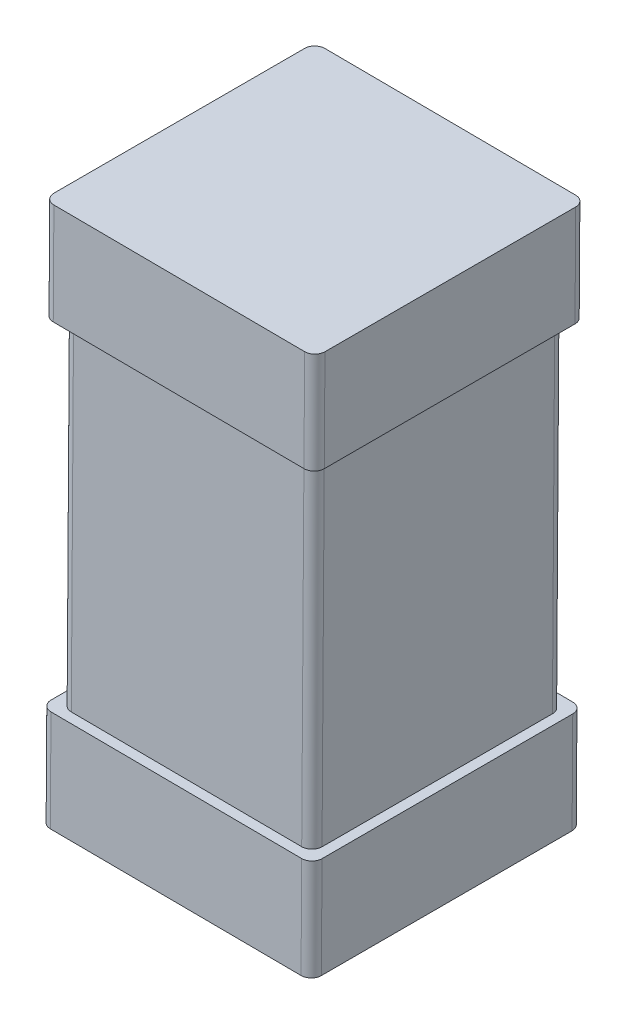
ISO-10303-21;
HEADER;
FILE_DESCRIPTION(('STEP AP214'),'2;1');
FILE_NAME('part.step','',(''),(''),'','','');
FILE_SCHEMA(('AUTOMOTIVE_DESIGN { 1 0 10303 214 1 1 1 1 }'));
ENDSEC;
DATA;
#1=APPLICATION_CONTEXT('core data for automotive mechanical design processes');
#2=APPLICATION_PROTOCOL_DEFINITION('international standard','automotive_design',2000,#1);
#3=PRODUCT_CONTEXT('',#1,'mechanical');
#4=PRODUCT('Part','Part','',(#3));
#5=PRODUCT_RELATED_PRODUCT_CATEGORY('part','',(#4));
#6=PRODUCT_DEFINITION_FORMATION('','',#4);
#7=PRODUCT_DEFINITION_CONTEXT('part definition',#1,'design');
#8=PRODUCT_DEFINITION('design','',#6,#7);
#9=PRODUCT_DEFINITION_SHAPE('','',#8);
#10=(LENGTH_UNIT() NAMED_UNIT(*) SI_UNIT(.MILLI.,.METRE.));
#11=(NAMED_UNIT(*) PLANE_ANGLE_UNIT() SI_UNIT($,.RADIAN.));
#12=(NAMED_UNIT(*) SI_UNIT($,.STERADIAN.) SOLID_ANGLE_UNIT());
#13=UNCERTAINTY_MEASURE_WITH_UNIT(LENGTH_MEASURE(1.E-05),#10,'distance_accuracy_value','');
#14=(GEOMETRIC_REPRESENTATION_CONTEXT(3) GLOBAL_UNCERTAINTY_ASSIGNED_CONTEXT((#13)) GLOBAL_UNIT_ASSIGNED_CONTEXT((#10,
#11,#12)) REPRESENTATION_CONTEXT('',''));
#15=CARTESIAN_POINT('',(0.,0.,0.));
#16=DIRECTION('',(0.,0.,1.));
#17=DIRECTION('',(1.,0.,0.));
#18=AXIS2_PLACEMENT_3D('',#15,#16,#17);
#19=CARTESIAN_POINT('',(197.940914667771,102.604065715772,142.211582908599));
#20=DIRECTION('',(0.00663069374923689,0.99997801670857,0.));
#21=DIRECTION('',(0.,0.,-1.));
#22=AXIS2_PLACEMENT_3D('',#19,#20,#21);
#23=PLANE('',#22);
#24=DIRECTION('',(0.,0.,1.));
#25=VECTOR('',#24,1.);
#26=CARTESIAN_POINT('',(197.940914667771,102.604065715772,142.211582908599));
#27=LINE('',#26,#25);
#28=CARTESIAN_POINT('',(197.940914667771,102.604065715772,142.241582908599));
#29=VERTEX_POINT('',#28);
#30=CARTESIAN_POINT('',(197.940914667771,102.604065715772,142.981582908599));
#31=VERTEX_POINT('',#30);
#32=EDGE_CURVE('E67',#29,#31,#27,.T.);
#33=ORIENTED_EDGE('',*,*,#32,.F.);
#34=CARTESIAN_POINT('',(197.91091532727,102.604264636585,142.241582908599));
#35=DIRECTION('',(0.00663069374923689,0.99997801670857,0.));
#36=DIRECTION('',(0.,0.,1.));
#37=AXIS2_PLACEMENT_3D('',#34,#35,#36);
#38=CIRCLE('',#37,0.0300000000000023);
#39=CARTESIAN_POINT('',(197.91091532727,102.604264636585,142.211582908599));
#40=VERTEX_POINT('',#39);
#41=EDGE_CURVE('E11',#29,#40,#38,.T.);
#42=ORIENTED_EDGE('',*,*,#41,.T.);
#43=DIRECTION('',(-0.999978016708569,0.00663069374923689,0.));
#44=VECTOR('',#43,1.);
#45=CARTESIAN_POINT('',(197.940914667771,102.604065715772,142.211582908599));
#46=LINE('',#45,#44);
#47=CARTESIAN_POINT('',(197.170931594906,102.609171349959,142.211582908599));
#48=VERTEX_POINT('',#47);
#49=EDGE_CURVE('E55',#40,#48,#46,.T.);
#50=ORIENTED_EDGE('',*,*,#49,.T.);
#51=CARTESIAN_POINT('',(197.170931594906,102.609171349959,142.241582908599));
#52=DIRECTION('',(-0.00663069374923689,-0.99997801670857,0.));
#53=DIRECTION('',(0.,0.,1.));
#54=AXIS2_PLACEMENT_3D('',#51,#52,#53);
#55=CIRCLE('',#54,0.0300000000000023);
#56=CARTESIAN_POINT('',(197.140932254405,102.609370270771,142.241582908599));
#57=VERTEX_POINT('',#56);
#58=EDGE_CURVE('E379',#57,#48,#55,.T.);
#59=ORIENTED_EDGE('',*,*,#58,.F.);
#60=DIRECTION('',(0.,0.,1.));
#61=VECTOR('',#60,1.);
#62=CARTESIAN_POINT('',(197.140932254405,102.609370270771,142.211582908599));
#63=LINE('',#62,#61);
#64=CARTESIAN_POINT('',(197.140932254405,102.609370270771,142.981582908599));
#65=VERTEX_POINT('',#64);
#66=EDGE_CURVE('E238',#57,#65,#63,.T.);
#67=ORIENTED_EDGE('',*,*,#66,.T.);
#68=CARTESIAN_POINT('',(197.170931594906,102.609171349959,142.981582908599));
#69=DIRECTION('',(0.00663069374923689,0.99997801670857,0.));
#70=DIRECTION('',(0.,0.,1.));
#71=AXIS2_PLACEMENT_3D('',#68,#69,#70);
#72=CIRCLE('',#71,0.0300000000000023);
#73=CARTESIAN_POINT('',(197.170931594906,102.609171349959,143.011582908599));
#74=VERTEX_POINT('',#73);
#75=EDGE_CURVE('E433',#65,#74,#72,.T.);
#76=ORIENTED_EDGE('',*,*,#75,.T.);
#77=DIRECTION('',(-0.999978016708569,0.00663069374923689,0.));
#78=VECTOR('',#77,1.);
#79=CARTESIAN_POINT('',(197.940914667771,102.604065715772,143.011582908599));
#80=LINE('',#79,#78);
#81=CARTESIAN_POINT('',(197.91091532727,102.604264636585,143.011582908599));
#82=VERTEX_POINT('',#81);
#83=EDGE_CURVE('E296',#82,#74,#80,.T.);
#84=ORIENTED_EDGE('',*,*,#83,.F.);
#85=CARTESIAN_POINT('',(197.91091532727,102.604264636585,142.981582908599));
#86=DIRECTION('',(-0.00663069374923689,-0.99997801670857,0.));
#87=DIRECTION('',(0.,0.,1.));
#88=AXIS2_PLACEMENT_3D('',#85,#86,#87);
#89=CIRCLE('',#88,0.0300000000000023);
#90=EDGE_CURVE('E263',#31,#82,#89,.T.);
#91=ORIENTED_EDGE('',*,*,#90,.F.);
#92=EDGE_LOOP('',(#33,#42,#50,#59,#67,#76,#84,#91));
#93=FACE_BOUND('',#92,.T.);
#94=ADVANCED_FACE('F44',(#93),#23,.T.);
#95=CARTESIAN_POINT('',(197.13894304628,102.309376865759,142.211582908599));
#96=DIRECTION('',(-0.99997801670857,0.00663069374923689,0.));
#97=DIRECTION('',(0.,0.,1.));
#98=AXIS2_PLACEMENT_3D('',#95,#96,#97);
#99=PLANE('',#98);
#100=ORIENTED_EDGE('',*,*,#66,.F.);
#101=DIRECTION('',(0.00663069374923689,0.999978016708569,0.));
#102=VECTOR('',#101,1.);
#103=CARTESIAN_POINT('',(197.13894304628,102.309376865759,142.241582908599));
#104=LINE('',#103,#102);
#105=CARTESIAN_POINT('',(197.13894304628,102.309376865759,142.241582908599));
#106=VERTEX_POINT('',#105);
#107=EDGE_CURVE('E136',#106,#57,#104,.T.);
#108=ORIENTED_EDGE('',*,*,#107,.F.);
#109=DIRECTION('',(0.,0.,1.));
#110=VECTOR('',#109,1.);
#111=CARTESIAN_POINT('',(197.13894304628,102.309376865759,142.211582908599));
#112=LINE('',#111,#110);
#113=CARTESIAN_POINT('',(197.13894304628,102.309376865759,142.981582908599));
#114=VERTEX_POINT('',#113);
#115=EDGE_CURVE('E327',#106,#114,#112,.T.);
#116=ORIENTED_EDGE('',*,*,#115,.T.);
#117=DIRECTION('',(0.00663069374923689,0.999978016708569,0.));
#118=VECTOR('',#117,1.);
#119=CARTESIAN_POINT('',(197.13894304628,102.309376865759,142.981582908599));
#120=LINE('',#119,#118);
#121=EDGE_CURVE('E323',#114,#65,#120,.T.);
#122=ORIENTED_EDGE('',*,*,#121,.T.);
#123=EDGE_LOOP('',(#100,#108,#116,#122));
#124=FACE_BOUND('',#123,.T.);
#125=ADVANCED_FACE('F553',(#124),#99,.T.);
#126=CARTESIAN_POINT('',(197.168942386781,102.309177944946,142.981582908599));
#127=DIRECTION('',(0.00663069374915559,0.99997801670857,0.));
#128=DIRECTION('',(-0.99997801670857,0.00663069374915559,0.));
#129=AXIS2_PLACEMENT_3D('',#126,#127,#128);
#130=CYLINDRICAL_SURFACE('',#129,0.0300000000000117);
#131=CARTESIAN_POINT('',(197.168942386781,102.309177944946,142.981582908599));
#132=DIRECTION('',(0.00663069374923689,0.99997801670857,0.));
#133=DIRECTION('',(0.,0.,1.));
#134=AXIS2_PLACEMENT_3D('',#131,#132,#133);
#135=CIRCLE('',#134,0.0300000000000023);
#136=CARTESIAN_POINT('',(197.168942386781,102.309177944946,143.011582908599));
#137=VERTEX_POINT('',#136);
#138=EDGE_CURVE('E302',#114,#137,#135,.T.);
#139=ORIENTED_EDGE('',*,*,#138,.T.);
#140=DIRECTION('',(0.00663069374923689,0.999978016708569,0.));
#141=VECTOR('',#140,1.);
#142=CARTESIAN_POINT('',(197.168942386781,102.309177944946,143.011582908599));
#143=LINE('',#142,#141);
#144=EDGE_CURVE('E298',#137,#74,#143,.T.);
#145=ORIENTED_EDGE('',*,*,#144,.T.);
#146=ORIENTED_EDGE('',*,*,#75,.F.);
#147=ORIENTED_EDGE('',*,*,#121,.F.);
#148=EDGE_LOOP('',(#139,#145,#146,#147));
#149=FACE_BOUND('',#148,.T.);
#150=ADVANCED_FACE('F461',(#149),#130,.T.);
#151=CARTESIAN_POINT('',(197.168942386781,102.309177944946,142.241582908599));
#152=DIRECTION('',(0.00663069374915559,0.99997801670857,0.));
#153=DIRECTION('',(-0.99997801670857,0.00663069374915559,0.));
#154=AXIS2_PLACEMENT_3D('',#151,#152,#153);
#155=CYLINDRICAL_SURFACE('',#154,0.0300000000000117);
#156=ORIENTED_EDGE('',*,*,#107,.T.);
#157=ORIENTED_EDGE('',*,*,#58,.T.);
#158=DIRECTION('',(0.00663069374923689,0.999978016708569,0.));
#159=VECTOR('',#158,1.);
#160=CARTESIAN_POINT('',(197.168942386781,102.309177944946,142.211582908599));
#161=LINE('',#160,#159);
#162=CARTESIAN_POINT('',(197.168942386781,102.309177944946,142.211582908599));
#163=VERTEX_POINT('',#162);
#164=EDGE_CURVE('E292',#163,#48,#161,.T.);
#165=ORIENTED_EDGE('',*,*,#164,.F.);
#166=CARTESIAN_POINT('',(197.168942386781,102.309177944946,142.241582908599));
#167=DIRECTION('',(-0.00663069374923689,-0.99997801670857,0.));
#168=DIRECTION('',(0.,0.,1.));
#169=AXIS2_PLACEMENT_3D('',#166,#167,#168);
#170=CIRCLE('',#169,0.0300000000000023);
#171=EDGE_CURVE('E214',#106,#163,#170,.T.);
#172=ORIENTED_EDGE('',*,*,#171,.F.);
#173=EDGE_LOOP('',(#156,#157,#165,#172));
#174=FACE_BOUND('',#173,.T.);
#175=ADVANCED_FACE('F46',(#174),#155,.T.);
#176=CARTESIAN_POINT('',(197.938925459646,102.304072310759,143.011582908599));
#177=DIRECTION('',(0.,0.,1.));
#178=DIRECTION('',(1.,0.,0.));
#179=AXIS2_PLACEMENT_3D('',#176,#177,#178);
#180=PLANE('',#179);
#181=DIRECTION('',(-0.999978016708569,0.00663069374923689,0.));
#182=VECTOR('',#181,1.);
#183=CARTESIAN_POINT('',(197.938925459646,102.304072310759,143.011582908599));
#184=LINE('',#183,#182);
#185=CARTESIAN_POINT('',(197.908926119145,102.304271231572,143.011582908599));
#186=VERTEX_POINT('',#185);
#187=EDGE_CURVE('E218',#186,#137,#184,.T.);
#188=ORIENTED_EDGE('',*,*,#187,.F.);
#189=DIRECTION('',(0.00663069374923689,0.999978016708569,0.));
#190=VECTOR('',#189,1.);
#191=CARTESIAN_POINT('',(197.908926119145,102.304271231572,143.011582908599));
#192=LINE('',#191,#190);
#193=EDGE_CURVE('E341',#186,#82,#192,.T.);
#194=ORIENTED_EDGE('',*,*,#193,.T.);
#195=ORIENTED_EDGE('',*,*,#83,.T.);
#196=ORIENTED_EDGE('',*,*,#144,.F.);
#197=EDGE_LOOP('',(#188,#194,#195,#196));
#198=FACE_BOUND('',#197,.T.);
#199=ADVANCED_FACE('F661',(#198),#180,.T.);
#200=CARTESIAN_POINT('',(197.938925459646,102.304072310759,142.211582908599));
#201=DIRECTION('',(0.,0.,1.));
#202=DIRECTION('',(1.,0.,0.));
#203=AXIS2_PLACEMENT_3D('',#200,#201,#202);
#204=PLANE('',#203);
#205=ORIENTED_EDGE('',*,*,#164,.T.);
#206=ORIENTED_EDGE('',*,*,#49,.F.);
#207=DIRECTION('',(0.00663069374923689,0.999978016708569,0.));
#208=VECTOR('',#207,1.);
#209=CARTESIAN_POINT('',(197.908926119145,102.304271231572,142.211582908599));
#210=LINE('',#209,#208);
#211=CARTESIAN_POINT('',(197.908926119145,102.304271231572,142.211582908599));
#212=VERTEX_POINT('',#211);
#213=EDGE_CURVE('E264',#212,#40,#210,.T.);
#214=ORIENTED_EDGE('',*,*,#213,.F.);
#215=DIRECTION('',(-0.999978016708569,0.00663069374923689,0.));
#216=VECTOR('',#215,1.);
#217=CARTESIAN_POINT('',(197.938925459646,102.304072310759,142.211582908599));
#218=LINE('',#217,#216);
#219=EDGE_CURVE('E297',#212,#163,#218,.T.);
#220=ORIENTED_EDGE('',*,*,#219,.T.);
#221=EDGE_LOOP('',(#205,#206,#214,#220));
#222=FACE_BOUND('',#221,.T.);
#223=ADVANCED_FACE('F475',(#222),#204,.F.);
#224=CARTESIAN_POINT('',(197.908926119145,102.304271231572,142.981582908599));
#225=DIRECTION('',(0.00663069374915559,0.99997801670857,0.));
#226=DIRECTION('',(0.99997801670857,-0.00663069374915559,0.));
#227=AXIS2_PLACEMENT_3D('',#224,#225,#226);
#228=CYLINDRICAL_SURFACE('',#227,0.0300000000000117);
#229=DIRECTION('',(0.00663069374923689,0.999978016708569,0.));
#230=VECTOR('',#229,1.);
#231=CARTESIAN_POINT('',(197.938925459646,102.304072310759,142.981582908599));
#232=LINE('',#231,#230);
#233=CARTESIAN_POINT('',(197.938925459646,102.304072310759,142.981582908599));
#234=VERTEX_POINT('',#233);
#235=EDGE_CURVE('E331',#234,#31,#232,.T.);
#236=ORIENTED_EDGE('',*,*,#235,.T.);
#237=ORIENTED_EDGE('',*,*,#90,.T.);
#238=ORIENTED_EDGE('',*,*,#193,.F.);
#239=CARTESIAN_POINT('',(197.908926119145,102.304271231572,142.981582908599));
#240=DIRECTION('',(-0.00663069374923689,-0.99997801670857,0.));
#241=DIRECTION('',(0.,0.,1.));
#242=AXIS2_PLACEMENT_3D('',#239,#240,#241);
#243=CIRCLE('',#242,0.0300000000000023);
#244=EDGE_CURVE('E216',#234,#186,#243,.T.);
#245=ORIENTED_EDGE('',*,*,#244,.F.);
#246=EDGE_LOOP('',(#236,#237,#238,#245));
#247=FACE_BOUND('',#246,.T.);
#248=ADVANCED_FACE('F673',(#247),#228,.T.);
#249=CARTESIAN_POINT('',(197.908926119145,102.304271231572,142.241582908599));
#250=DIRECTION('',(0.00663069374915559,0.99997801670857,0.));
#251=DIRECTION('',(0.99997801670857,-0.00663069374915559,0.));
#252=AXIS2_PLACEMENT_3D('',#249,#250,#251);
#253=CYLINDRICAL_SURFACE('',#252,0.0300000000000117);
#254=CARTESIAN_POINT('',(197.908926119145,102.304271231572,142.241582908599));
#255=DIRECTION('',(0.00663069374923689,0.99997801670857,0.));
#256=DIRECTION('',(0.,0.,1.));
#257=AXIS2_PLACEMENT_3D('',#254,#255,#256);
#258=CIRCLE('',#257,0.0300000000000023);
#259=CARTESIAN_POINT('',(197.938925459646,102.304072310759,142.241582908599));
#260=VERTEX_POINT('',#259);
#261=EDGE_CURVE('E260',#260,#212,#258,.T.);
#262=ORIENTED_EDGE('',*,*,#261,.T.);
#263=ORIENTED_EDGE('',*,*,#213,.T.);
#264=ORIENTED_EDGE('',*,*,#41,.F.);
#265=DIRECTION('',(0.00663069374923689,0.999978016708569,0.));
#266=VECTOR('',#265,1.);
#267=CARTESIAN_POINT('',(197.938925459646,102.304072310759,142.241582908599));
#268=LINE('',#267,#266);
#269=EDGE_CURVE('E226',#260,#29,#268,.T.);
#270=ORIENTED_EDGE('',*,*,#269,.F.);
#271=EDGE_LOOP('',(#262,#263,#264,#270));
#272=FACE_BOUND('',#271,.T.);
#273=ADVANCED_FACE('F477',(#272),#253,.T.);
#274=CARTESIAN_POINT('',(197.938925459646,102.304072310759,142.211582908599));
#275=DIRECTION('',(-0.99997801670857,0.00663069374923689,0.));
#276=DIRECTION('',(0.,0.,1.));
#277=AXIS2_PLACEMENT_3D('',#274,#275,#276);
#278=PLANE('',#277);
#279=ORIENTED_EDGE('',*,*,#235,.F.);
#280=DIRECTION('',(0.,0.,1.));
#281=VECTOR('',#280,1.);
#282=CARTESIAN_POINT('',(197.938925459646,102.304072310759,142.211582908599));
#283=LINE('',#282,#281);
#284=EDGE_CURVE('E235',#260,#234,#283,.T.);
#285=ORIENTED_EDGE('',*,*,#284,.F.);
#286=ORIENTED_EDGE('',*,*,#269,.T.);
#287=ORIENTED_EDGE('',*,*,#32,.T.);
#288=EDGE_LOOP('',(#279,#285,#286,#287));
#289=FACE_BOUND('',#288,.T.);
#290=ADVANCED_FACE('F562',(#289),#278,.F.);
#291=CARTESIAN_POINT('',(197.938925459646,102.304072310759,142.211582908599));
#292=DIRECTION('',(0.00663069374923689,0.99997801670857,0.));
#293=DIRECTION('',(0.,0.,-1.));
#294=AXIS2_PLACEMENT_3D('',#291,#292,#293);
#295=PLANE('',#294);
#296=ORIENTED_EDGE('',*,*,#244,.T.);
#297=ORIENTED_EDGE('',*,*,#187,.T.);
#298=ORIENTED_EDGE('',*,*,#138,.F.);
#299=ORIENTED_EDGE('',*,*,#115,.F.);
#300=ORIENTED_EDGE('',*,*,#171,.T.);
#301=ORIENTED_EDGE('',*,*,#219,.F.);
#302=ORIENTED_EDGE('',*,*,#261,.F.);
#303=ORIENTED_EDGE('',*,*,#284,.T.);
#304=EDGE_LOOP('',(#296,#297,#298,#299,#300,#301,#302,#303));
#305=FACE_BOUND('',#304,.T.);
#306=DIRECTION('',(-0.999978016708569,0.00663069374923689,0.));
#307=VECTOR('',#306,1.);
#308=CARTESIAN_POINT('',(197.908926119145,102.304271231572,142.241582908599));
#309=LINE('',#308,#307);
#310=CARTESIAN_POINT('',(197.878926778644,102.304470152384,142.241582908599));
#311=VERTEX_POINT('',#310);
#312=CARTESIAN_POINT('',(197.198941727282,102.308979024134,142.241582908599));
#313=VERTEX_POINT('',#312);
#314=EDGE_CURVE('E241',#311,#313,#309,.T.);
#315=ORIENTED_EDGE('',*,*,#314,.T.);
#316=CARTESIAN_POINT('',(197.198941727282,102.308979024134,142.271582908599));
#317=DIRECTION('',(-0.00663069374923689,-0.99997801670857,0.));
#318=DIRECTION('',(0.,0.,1.));
#319=AXIS2_PLACEMENT_3D('',#316,#317,#318);
#320=CIRCLE('',#319,0.0300000000000023);
#321=CARTESIAN_POINT('',(197.168942386781,102.309177944946,142.271582908599));
#322=VERTEX_POINT('',#321);
#323=EDGE_CURVE('E245',#322,#313,#320,.T.);
#324=ORIENTED_EDGE('',*,*,#323,.F.);
#325=DIRECTION('',(0.,0.,1.));
#326=VECTOR('',#325,1.);
#327=CARTESIAN_POINT('',(197.168942386781,102.309177944946,142.241582908599));
#328=LINE('',#327,#326);
#329=CARTESIAN_POINT('',(197.168942386781,102.309177944946,142.951582908599));
#330=VERTEX_POINT('',#329);
#331=EDGE_CURVE('E345',#322,#330,#328,.T.);
#332=ORIENTED_EDGE('',*,*,#331,.T.);
#333=CARTESIAN_POINT('',(197.198941727282,102.308979024134,142.951582908599));
#334=DIRECTION('',(0.00663069374923689,0.99997801670857,0.));
#335=DIRECTION('',(0.,0.,1.));
#336=AXIS2_PLACEMENT_3D('',#333,#334,#335);
#337=CIRCLE('',#336,0.0300000000000023);
#338=CARTESIAN_POINT('',(197.198941727282,102.308979024134,142.981582908599));
#339=VERTEX_POINT('',#338);
#340=EDGE_CURVE('E349',#330,#339,#337,.T.);
#341=ORIENTED_EDGE('',*,*,#340,.T.);
#342=DIRECTION('',(-0.999978016708569,0.00663069374923689,0.));
#343=VECTOR('',#342,1.);
#344=CARTESIAN_POINT('',(197.908926119145,102.304271231572,142.981582908599));
#345=LINE('',#344,#343);
#346=CARTESIAN_POINT('',(197.878926778644,102.304470152384,142.981582908599));
#347=VERTEX_POINT('',#346);
#348=EDGE_CURVE('E399',#347,#339,#345,.T.);
#349=ORIENTED_EDGE('',*,*,#348,.F.);
#350=CARTESIAN_POINT('',(197.878926778644,102.304470152384,142.951582908599));
#351=DIRECTION('',(-0.00663069374923689,-0.99997801670857,0.));
#352=DIRECTION('',(0.,0.,1.));
#353=AXIS2_PLACEMENT_3D('',#350,#351,#352);
#354=CIRCLE('',#353,0.0300000000000023);
#355=CARTESIAN_POINT('',(197.908926119145,102.304271231572,142.951582908599));
#356=VERTEX_POINT('',#355);
#357=EDGE_CURVE('E303',#356,#347,#354,.T.);
#358=ORIENTED_EDGE('',*,*,#357,.F.);
#359=DIRECTION('',(0.,0.,1.));
#360=VECTOR('',#359,1.);
#361=CARTESIAN_POINT('',(197.908926119145,102.304271231572,142.241582908599));
#362=LINE('',#361,#360);
#363=CARTESIAN_POINT('',(197.908926119145,102.304271231572,142.271582908599));
#364=VERTEX_POINT('',#363);
#365=EDGE_CURVE('E309',#364,#356,#362,.T.);
#366=ORIENTED_EDGE('',*,*,#365,.F.);
#367=CARTESIAN_POINT('',(197.878926778644,102.304470152384,142.271582908599));
#368=DIRECTION('',(0.00663069374923689,0.99997801670857,0.));
#369=DIRECTION('',(0.,0.,1.));
#370=AXIS2_PLACEMENT_3D('',#367,#368,#369);
#371=CIRCLE('',#370,0.0300000000000023);
#372=EDGE_CURVE('E350',#364,#311,#371,.T.);
#373=ORIENTED_EDGE('',*,*,#372,.T.);
#374=EDGE_LOOP('',(#315,#324,#332,#341,#349,#358,#366,#373));
#375=FACE_BOUND('',#374,.T.);
#376=ADVANCED_FACE('F465',(#305,#375),#295,.F.);
#377=CARTESIAN_POINT('',(197.902295425396,101.304293214863,142.241582908599));
#378=DIRECTION('',(-0.99997801670857,0.00663069374923689,0.));
#379=DIRECTION('',(0.,0.,1.));
#380=AXIS2_PLACEMENT_3D('',#377,#378,#379);
#381=PLANE('',#380);
#382=DIRECTION('',(0.00663069374923689,0.999978016708569,0.));
#383=VECTOR('',#382,1.);
#384=CARTESIAN_POINT('',(197.902295425396,101.304293214863,142.951582908599));
#385=LINE('',#384,#383);
#386=CARTESIAN_POINT('',(197.902295425396,101.304293214863,142.951582908599));
#387=VERTEX_POINT('',#386);
#388=EDGE_CURVE('E307',#387,#356,#385,.T.);
#389=ORIENTED_EDGE('',*,*,#388,.F.);
#390=DIRECTION('',(0.,0.,1.));
#391=VECTOR('',#390,1.);
#392=CARTESIAN_POINT('',(197.902295425396,101.304293214863,142.241582908599));
#393=LINE('',#392,#391);
#394=CARTESIAN_POINT('',(197.902295425396,101.304293214863,142.271582908599));
#395=VERTEX_POINT('',#394);
#396=EDGE_CURVE('E402',#395,#387,#393,.T.);
#397=ORIENTED_EDGE('',*,*,#396,.F.);
#398=DIRECTION('',(0.00663069374923689,0.999978016708569,0.));
#399=VECTOR('',#398,1.);
#400=CARTESIAN_POINT('',(197.902295425396,101.304293214863,142.271582908599));
#401=LINE('',#400,#399);
#402=EDGE_CURVE('E313',#395,#364,#401,.T.);
#403=ORIENTED_EDGE('',*,*,#402,.T.);
#404=ORIENTED_EDGE('',*,*,#365,.T.);
#405=EDGE_LOOP('',(#389,#397,#403,#404));
#406=FACE_BOUND('',#405,.T.);
#407=ADVANCED_FACE('F578',(#406),#381,.F.);
#408=CARTESIAN_POINT('',(197.872296084895,101.304492135676,142.951582908599));
#409=DIRECTION('',(0.00663069374915559,0.99997801670857,0.));
#410=DIRECTION('',(0.99997801670857,-0.00663069374915559,0.));
#411=AXIS2_PLACEMENT_3D('',#408,#409,#410);
#412=CYLINDRICAL_SURFACE('',#411,0.0300000000000117);
#413=ORIENTED_EDGE('',*,*,#388,.T.);
#414=ORIENTED_EDGE('',*,*,#357,.T.);
#415=DIRECTION('',(0.00663069374923689,0.999978016708569,0.));
#416=VECTOR('',#415,1.);
#417=CARTESIAN_POINT('',(197.872296084895,101.304492135676,142.981582908599));
#418=LINE('',#417,#416);
#419=CARTESIAN_POINT('',(197.872296084895,101.304492135676,142.981582908599));
#420=VERTEX_POINT('',#419);
#421=EDGE_CURVE('E308',#420,#347,#418,.T.);
#422=ORIENTED_EDGE('',*,*,#421,.F.);
#423=CARTESIAN_POINT('',(197.872296084895,101.304492135676,142.951582908599));
#424=DIRECTION('',(-0.00663069374923689,-0.99997801670857,0.));
#425=DIRECTION('',(0.,0.,1.));
#426=AXIS2_PLACEMENT_3D('',#423,#424,#425);
#427=CIRCLE('',#426,0.0300000000000023);
#428=EDGE_CURVE('E360',#387,#420,#427,.T.);
#429=ORIENTED_EDGE('',*,*,#428,.F.);
#430=EDGE_LOOP('',(#413,#414,#422,#429));
#431=FACE_BOUND('',#430,.T.);
#432=ADVANCED_FACE('F571',(#431),#412,.T.);
#433=CARTESIAN_POINT('',(197.902295425396,101.304293214863,142.981582908599));
#434=DIRECTION('',(0.,0.,1.));
#435=DIRECTION('',(1.,0.,0.));
#436=AXIS2_PLACEMENT_3D('',#433,#434,#435);
#437=PLANE('',#436);
#438=DIRECTION('',(-0.999978016708569,0.00663069374923689,0.));
#439=VECTOR('',#438,1.);
#440=CARTESIAN_POINT('',(197.902295425396,101.304293214863,142.981582908599));
#441=LINE('',#440,#439);
#442=CARTESIAN_POINT('',(197.192311033533,101.309001007425,142.981582908599));
#443=VERTEX_POINT('',#442);
#444=EDGE_CURVE('E356',#420,#443,#441,.T.);
#445=ORIENTED_EDGE('',*,*,#444,.F.);
#446=ORIENTED_EDGE('',*,*,#421,.T.);
#447=ORIENTED_EDGE('',*,*,#348,.T.);
#448=DIRECTION('',(0.00663069374923689,0.999978016708569,0.));
#449=VECTOR('',#448,1.);
#450=CARTESIAN_POINT('',(197.192311033533,101.309001007425,142.981582908599));
#451=LINE('',#450,#449);
#452=EDGE_CURVE('E278',#443,#339,#451,.T.);
#453=ORIENTED_EDGE('',*,*,#452,.F.);
#454=EDGE_LOOP('',(#445,#446,#447,#453));
#455=FACE_BOUND('',#454,.T.);
#456=ADVANCED_FACE('F569',(#455),#437,.T.);
#457=CARTESIAN_POINT('',(197.192311033533,101.309001007425,142.951582908599));
#458=DIRECTION('',(0.00663069374915559,0.99997801670857,0.));
#459=DIRECTION('',(-0.99997801670857,0.00663069374915559,0.));
#460=AXIS2_PLACEMENT_3D('',#457,#458,#459);
#461=CYLINDRICAL_SURFACE('',#460,0.0300000000000117);
#462=CARTESIAN_POINT('',(197.192311033533,101.309001007425,142.951582908599));
#463=DIRECTION('',(0.00663069374923689,0.99997801670857,0.));
#464=DIRECTION('',(0.,0.,1.));
#465=AXIS2_PLACEMENT_3D('',#462,#463,#464);
#466=CIRCLE('',#465,0.0300000000000023);
#467=CARTESIAN_POINT('',(197.162311693032,101.309199928238,142.951582908599));
#468=VERTEX_POINT('',#467);
#469=EDGE_CURVE('E395',#468,#443,#466,.T.);
#470=ORIENTED_EDGE('',*,*,#469,.T.);
#471=ORIENTED_EDGE('',*,*,#452,.T.);
#472=ORIENTED_EDGE('',*,*,#340,.F.);
#473=DIRECTION('',(0.00663069374923689,0.999978016708569,0.));
#474=VECTOR('',#473,1.);
#475=CARTESIAN_POINT('',(197.162311693032,101.309199928238,142.951582908599));
#476=LINE('',#475,#474);
#477=EDGE_CURVE('E286',#468,#330,#476,.T.);
#478=ORIENTED_EDGE('',*,*,#477,.F.);
#479=EDGE_LOOP('',(#470,#471,#472,#478));
#480=FACE_BOUND('',#479,.T.);
#481=ADVANCED_FACE('F561',(#480),#461,.T.);
#482=CARTESIAN_POINT('',(197.162311693032,101.309199928238,142.241582908599));
#483=DIRECTION('',(-0.99997801670857,0.00663069374923689,0.));
#484=DIRECTION('',(0.,0.,1.));
#485=AXIS2_PLACEMENT_3D('',#482,#483,#484);
#486=PLANE('',#485);
#487=ORIENTED_EDGE('',*,*,#331,.F.);
#488=DIRECTION('',(0.00663069374923689,0.999978016708569,0.));
#489=VECTOR('',#488,1.);
#490=CARTESIAN_POINT('',(197.162311693032,101.309199928238,142.271582908599));
#491=LINE('',#490,#489);
#492=CARTESIAN_POINT('',(197.162311693032,101.309199928238,142.271582908599));
#493=VERTEX_POINT('',#492);
#494=EDGE_CURVE('E291',#493,#322,#491,.T.);
#495=ORIENTED_EDGE('',*,*,#494,.F.);
#496=DIRECTION('',(0.,0.,1.));
#497=VECTOR('',#496,1.);
#498=CARTESIAN_POINT('',(197.162311693032,101.309199928238,142.241582908599));
#499=LINE('',#498,#497);
#500=EDGE_CURVE('E290',#493,#468,#499,.T.);
#501=ORIENTED_EDGE('',*,*,#500,.T.);
#502=ORIENTED_EDGE('',*,*,#477,.T.);
#503=EDGE_LOOP('',(#487,#495,#501,#502));
#504=FACE_BOUND('',#503,.T.);
#505=ADVANCED_FACE('F565',(#504),#486,.T.);
#506=CARTESIAN_POINT('',(197.192311033533,101.309001007425,142.271582908599));
#507=DIRECTION('',(0.00663069374915559,0.99997801670857,0.));
#508=DIRECTION('',(-0.99997801670857,0.00663069374915559,0.));
#509=AXIS2_PLACEMENT_3D('',#506,#507,#508);
#510=CYLINDRICAL_SURFACE('',#509,0.0300000000000117);
#511=ORIENTED_EDGE('',*,*,#494,.T.);
#512=ORIENTED_EDGE('',*,*,#323,.T.);
#513=DIRECTION('',(0.00663069374923689,0.999978016708569,0.));
#514=VECTOR('',#513,1.);
#515=CARTESIAN_POINT('',(197.192311033533,101.309001007425,142.241582908599));
#516=LINE('',#515,#514);
#517=CARTESIAN_POINT('',(197.192311033533,101.309001007425,142.241582908599));
#518=VERTEX_POINT('',#517);
#519=EDGE_CURVE('E242',#518,#313,#516,.T.);
#520=ORIENTED_EDGE('',*,*,#519,.F.);
#521=CARTESIAN_POINT('',(197.192311033533,101.309001007425,142.271582908599));
#522=DIRECTION('',(-0.00663069374923689,-0.99997801670857,0.));
#523=DIRECTION('',(0.,0.,1.));
#524=AXIS2_PLACEMENT_3D('',#521,#522,#523);
#525=CIRCLE('',#524,0.0300000000000023);
#526=EDGE_CURVE('E48',#493,#518,#525,.T.);
#527=ORIENTED_EDGE('',*,*,#526,.F.);
#528=EDGE_LOOP('',(#511,#512,#520,#527));
#529=FACE_BOUND('',#528,.T.);
#530=ADVANCED_FACE('F567',(#529),#510,.T.);
#531=CARTESIAN_POINT('',(197.902295425396,101.304293214863,142.241582908599));
#532=DIRECTION('',(0.,0.,1.));
#533=DIRECTION('',(1.,0.,0.));
#534=AXIS2_PLACEMENT_3D('',#531,#532,#533);
#535=PLANE('',#534);
#536=ORIENTED_EDGE('',*,*,#519,.T.);
#537=ORIENTED_EDGE('',*,*,#314,.F.);
#538=DIRECTION('',(0.00663069374923689,0.999978016708569,0.));
#539=VECTOR('',#538,1.);
#540=CARTESIAN_POINT('',(197.872296084895,101.304492135676,142.241582908599));
#541=LINE('',#540,#539);
#542=CARTESIAN_POINT('',(197.872296084895,101.304492135676,142.241582908599));
#543=VERTEX_POINT('',#542);
#544=EDGE_CURVE('E319',#543,#311,#541,.T.);
#545=ORIENTED_EDGE('',*,*,#544,.F.);
#546=DIRECTION('',(-0.999978016708569,0.00663069374923689,0.));
#547=VECTOR('',#546,1.);
#548=CARTESIAN_POINT('',(197.902295425396,101.304293214863,142.241582908599));
#549=LINE('',#548,#547);
#550=EDGE_CURVE('E246',#543,#518,#549,.T.);
#551=ORIENTED_EDGE('',*,*,#550,.T.);
#552=EDGE_LOOP('',(#536,#537,#545,#551));
#553=FACE_BOUND('',#552,.T.);
#554=ADVANCED_FACE('F607',(#553),#535,.F.);
#555=CARTESIAN_POINT('',(197.872296084895,101.304492135676,142.271582908599));
#556=DIRECTION('',(0.00663069374915559,0.99997801670857,0.));
#557=DIRECTION('',(0.99997801670857,-0.00663069374915559,0.));
#558=AXIS2_PLACEMENT_3D('',#555,#556,#557);
#559=CYLINDRICAL_SURFACE('',#558,0.0300000000000117);
#560=CARTESIAN_POINT('',(197.872296084895,101.304492135676,142.271582908599));
#561=DIRECTION('',(0.00663069374923689,0.99997801670857,0.));
#562=DIRECTION('',(0.,0.,1.));
#563=AXIS2_PLACEMENT_3D('',#560,#561,#562);
#564=CIRCLE('',#563,0.0300000000000023);
#565=EDGE_CURVE('E282',#395,#543,#564,.T.);
#566=ORIENTED_EDGE('',*,*,#565,.T.);
#567=ORIENTED_EDGE('',*,*,#544,.T.);
#568=ORIENTED_EDGE('',*,*,#372,.F.);
#569=ORIENTED_EDGE('',*,*,#402,.F.);
#570=EDGE_LOOP('',(#566,#567,#568,#569));
#571=FACE_BOUND('',#570,.T.);
#572=ADVANCED_FACE('F599',(#571),#559,.T.);
#573=CARTESIAN_POINT('',(197.932294765898,101.304094294051,142.211582908599));
#574=DIRECTION('',(0.00663069374923689,0.99997801670857,0.));
#575=DIRECTION('',(0.,0.,-1.));
#576=AXIS2_PLACEMENT_3D('',#573,#574,#575);
#577=PLANE('',#576);
#578=DIRECTION('',(0.,0.,1.));
#579=VECTOR('',#578,1.);
#580=CARTESIAN_POINT('',(197.932294765898,101.304094294051,142.211582908599));
#581=LINE('',#580,#579);
#582=CARTESIAN_POINT('',(197.932294765898,101.304094294051,142.241582908599));
#583=VERTEX_POINT('',#582);
#584=CARTESIAN_POINT('',(197.932294765898,101.304094294051,142.981582908599));
#585=VERTEX_POINT('',#584);
#586=EDGE_CURVE('E189',#583,#585,#581,.T.);
#587=ORIENTED_EDGE('',*,*,#586,.F.);
#588=CARTESIAN_POINT('',(197.902295425396,101.304293214863,142.241582908599));
#589=DIRECTION('',(0.00663069374923689,0.99997801670857,0.));
#590=DIRECTION('',(0.,0.,1.));
#591=AXIS2_PLACEMENT_3D('',#588,#589,#590);
#592=CIRCLE('',#591,0.0300000000000023);
#593=CARTESIAN_POINT('',(197.902295425396,101.304293214863,142.211582908599));
#594=VERTEX_POINT('',#593);
#595=EDGE_CURVE('E183',#583,#594,#592,.T.);
#596=ORIENTED_EDGE('',*,*,#595,.T.);
#597=DIRECTION('',(-0.999978016708569,0.00663069374923689,0.));
#598=VECTOR('',#597,1.);
#599=CARTESIAN_POINT('',(197.932294765898,101.304094294051,142.211582908599));
#600=LINE('',#599,#598);
#601=CARTESIAN_POINT('',(197.162311693032,101.309199928238,142.211582908599));
#602=VERTEX_POINT('',#601);
#603=EDGE_CURVE('E368',#594,#602,#600,.T.);
#604=ORIENTED_EDGE('',*,*,#603,.T.);
#605=CARTESIAN_POINT('',(197.162311693032,101.309199928238,142.241582908599));
#606=DIRECTION('',(-0.00663069374923689,-0.99997801670857,0.));
#607=DIRECTION('',(0.,0.,1.));
#608=AXIS2_PLACEMENT_3D('',#605,#606,#607);
#609=CIRCLE('',#608,0.0300000000000023);
#610=CARTESIAN_POINT('',(197.132312352531,101.30939884905,142.241582908599));
#611=VERTEX_POINT('',#610);
#612=EDGE_CURVE('E253',#611,#602,#609,.T.);
#613=ORIENTED_EDGE('',*,*,#612,.F.);
#614=DIRECTION('',(0.,0.,1.));
#615=VECTOR('',#614,1.);
#616=CARTESIAN_POINT('',(197.132312352531,101.30939884905,142.211582908599));
#617=LINE('',#616,#615);
#618=CARTESIAN_POINT('',(197.132312352531,101.30939884905,142.981582908599));
#619=VERTEX_POINT('',#618);
#620=EDGE_CURVE('E364',#611,#619,#617,.T.);
#621=ORIENTED_EDGE('',*,*,#620,.T.);
#622=CARTESIAN_POINT('',(197.162311693032,101.309199928238,142.981582908599));
#623=DIRECTION('',(0.00663069374923689,0.99997801670857,0.));
#624=DIRECTION('',(0.,0.,1.));
#625=AXIS2_PLACEMENT_3D('',#622,#623,#624);
#626=CIRCLE('',#625,0.0300000000000023);
#627=CARTESIAN_POINT('',(197.162311693032,101.309199928238,143.011582908599));
#628=VERTEX_POINT('',#627);
#629=EDGE_CURVE('E369',#619,#628,#626,.T.);
#630=ORIENTED_EDGE('',*,*,#629,.T.);
#631=DIRECTION('',(-0.999978016708569,0.00663069374923689,0.));
#632=VECTOR('',#631,1.);
#633=CARTESIAN_POINT('',(197.932294765898,101.304094294051,143.011582908599));
#634=LINE('',#633,#632);
#635=CARTESIAN_POINT('',(197.902295425396,101.304293214863,143.011582908599));
#636=VERTEX_POINT('',#635);
#637=EDGE_CURVE('E334',#636,#628,#634,.T.);
#638=ORIENTED_EDGE('',*,*,#637,.F.);
#639=CARTESIAN_POINT('',(197.902295425396,101.304293214863,142.981582908599));
#640=DIRECTION('',(-0.00663069374923689,-0.99997801670857,0.));
#641=DIRECTION('',(0.,0.,1.));
#642=AXIS2_PLACEMENT_3D('',#639,#640,#641);
#643=CIRCLE('',#642,0.0300000000000023);
#644=EDGE_CURVE('E200',#585,#636,#643,.T.);
#645=ORIENTED_EDGE('',*,*,#644,.F.);
#646=EDGE_LOOP('',(#587,#596,#604,#613,#621,#630,#638,#645));
#647=FACE_BOUND('',#646,.T.);
#648=ORIENTED_EDGE('',*,*,#565,.F.);
#649=ORIENTED_EDGE('',*,*,#396,.T.);
#650=ORIENTED_EDGE('',*,*,#428,.T.);
#651=ORIENTED_EDGE('',*,*,#444,.T.);
#652=ORIENTED_EDGE('',*,*,#469,.F.);
#653=ORIENTED_EDGE('',*,*,#500,.F.);
#654=ORIENTED_EDGE('',*,*,#526,.T.);
#655=ORIENTED_EDGE('',*,*,#550,.F.);
#656=EDGE_LOOP('',(#648,#649,#650,#651,#652,#653,#654,#655));
#657=FACE_BOUND('',#656,.T.);
#658=ADVANCED_FACE('F535',(#647,#657),#577,.T.);
#659=CARTESIAN_POINT('',(197.130323144406,101.009405444038,142.211582908599));
#660=DIRECTION('',(-0.99997801670857,0.00663069374923689,0.));
#661=DIRECTION('',(0.,0.,1.));
#662=AXIS2_PLACEMENT_3D('',#659,#660,#661);
#663=PLANE('',#662);
#664=ORIENTED_EDGE('',*,*,#620,.F.);
#665=DIRECTION('',(0.00663069374923689,0.999978016708569,0.));
#666=VECTOR('',#665,1.);
#667=CARTESIAN_POINT('',(197.130323144406,101.009405444038,142.241582908599));
#668=LINE('',#667,#666);
#669=CARTESIAN_POINT('',(197.130323144406,101.009405444038,142.241582908599));
#670=VERTEX_POINT('',#669);
#671=EDGE_CURVE('E248',#670,#611,#668,.T.);
#672=ORIENTED_EDGE('',*,*,#671,.F.);
#673=DIRECTION('',(0.,0.,1.));
#674=VECTOR('',#673,1.);
#675=CARTESIAN_POINT('',(197.130323144406,101.009405444038,142.211582908599));
#676=LINE('',#675,#674);
#677=CARTESIAN_POINT('',(197.130323144406,101.009405444038,142.981582908599));
#678=VERTEX_POINT('',#677);
#679=EDGE_CURVE('E314',#670,#678,#676,.T.);
#680=ORIENTED_EDGE('',*,*,#679,.T.);
#681=DIRECTION('',(0.00663069374923689,0.999978016708569,0.));
#682=VECTOR('',#681,1.);
#683=CARTESIAN_POINT('',(197.130323144406,101.009405444038,142.981582908599));
#684=LINE('',#683,#682);
#685=EDGE_CURVE('E318',#678,#619,#684,.T.);
#686=ORIENTED_EDGE('',*,*,#685,.T.);
#687=EDGE_LOOP('',(#664,#672,#680,#686));
#688=FACE_BOUND('',#687,.T.);
#689=ADVANCED_FACE('F632',(#688),#663,.T.);
#690=CARTESIAN_POINT('',(197.160322484907,101.009206523225,142.981582908599));
#691=DIRECTION('',(0.00663069374915559,0.99997801670857,0.));
#692=DIRECTION('',(-0.99997801670857,0.00663069374915559,0.));
#693=AXIS2_PLACEMENT_3D('',#690,#691,#692);
#694=CYLINDRICAL_SURFACE('',#693,0.0300000000000117);
#695=CARTESIAN_POINT('',(197.160322484907,101.009206523225,142.981582908599));
#696=DIRECTION('',(0.00663069374923689,0.99997801670857,0.));
#697=DIRECTION('',(0.,0.,1.));
#698=AXIS2_PLACEMENT_3D('',#695,#696,#697);
#699=CIRCLE('',#698,0.0300000000000023);
#700=CARTESIAN_POINT('',(197.160322484907,101.009206523225,143.011582908599));
#701=VERTEX_POINT('',#700);
#702=EDGE_CURVE('E257',#678,#701,#699,.T.);
#703=ORIENTED_EDGE('',*,*,#702,.T.);
#704=DIRECTION('',(0.00663069374923689,0.999978016708569,0.));
#705=VECTOR('',#704,1.);
#706=CARTESIAN_POINT('',(197.160322484907,101.009206523225,143.011582908599));
#707=LINE('',#706,#705);
#708=EDGE_CURVE('E252',#701,#628,#707,.T.);
#709=ORIENTED_EDGE('',*,*,#708,.T.);
#710=ORIENTED_EDGE('',*,*,#629,.F.);
#711=ORIENTED_EDGE('',*,*,#685,.F.);
#712=EDGE_LOOP('',(#703,#709,#710,#711));
#713=FACE_BOUND('',#712,.T.);
#714=ADVANCED_FACE('F414',(#713),#694,.T.);
#715=CARTESIAN_POINT('',(197.160322484907,101.009206523225,142.241582908599));
#716=DIRECTION('',(0.00663069374915559,0.99997801670857,0.));
#717=DIRECTION('',(-0.99997801670857,0.00663069374915559,0.));
#718=AXIS2_PLACEMENT_3D('',#715,#716,#717);
#719=CYLINDRICAL_SURFACE('',#718,0.0300000000000117);
#720=ORIENTED_EDGE('',*,*,#671,.T.);
#721=ORIENTED_EDGE('',*,*,#612,.T.);
#722=DIRECTION('',(0.00663069374923689,0.999978016708569,0.));
#723=VECTOR('',#722,1.);
#724=CARTESIAN_POINT('',(197.160322484907,101.009206523225,142.211582908599));
#725=LINE('',#724,#723);
#726=CARTESIAN_POINT('',(197.160322484907,101.009206523225,142.211582908599));
#727=VERTEX_POINT('',#726);
#728=EDGE_CURVE('E285',#727,#602,#725,.T.);
#729=ORIENTED_EDGE('',*,*,#728,.F.);
#730=CARTESIAN_POINT('',(197.160322484907,101.009206523225,142.241582908599));
#731=DIRECTION('',(-0.00663069374923689,-0.99997801670857,0.));
#732=DIRECTION('',(0.,0.,1.));
#733=AXIS2_PLACEMENT_3D('',#730,#731,#732);
#734=CIRCLE('',#733,0.0300000000000023);
#735=EDGE_CURVE('E205',#670,#727,#734,.T.);
#736=ORIENTED_EDGE('',*,*,#735,.F.);
#737=EDGE_LOOP('',(#720,#721,#729,#736));
#738=FACE_BOUND('',#737,.T.);
#739=ADVANCED_FACE('F540',(#738),#719,.T.);
#740=CARTESIAN_POINT('',(197.930305557772,101.004100889038,143.011582908599));
#741=DIRECTION('',(0.,0.,1.));
#742=DIRECTION('',(1.,0.,0.));
#743=AXIS2_PLACEMENT_3D('',#740,#741,#742);
#744=PLANE('',#743);
#745=DIRECTION('',(-0.999978016708569,0.00663069374923689,0.));
#746=VECTOR('',#745,1.);
#747=CARTESIAN_POINT('',(197.930305557772,101.004100889038,143.011582908599));
#748=LINE('',#747,#746);
#749=CARTESIAN_POINT('',(197.900306217271,101.004299809851,143.011582908599));
#750=VERTEX_POINT('',#749);
#751=EDGE_CURVE('E211',#750,#701,#748,.T.);
#752=ORIENTED_EDGE('',*,*,#751,.F.);
#753=DIRECTION('',(0.00663069374923689,0.999978016708569,0.));
#754=VECTOR('',#753,1.);
#755=CARTESIAN_POINT('',(197.900306217271,101.004299809851,143.011582908599));
#756=LINE('',#755,#754);
#757=EDGE_CURVE('E337',#750,#636,#756,.T.);
#758=ORIENTED_EDGE('',*,*,#757,.T.);
#759=ORIENTED_EDGE('',*,*,#637,.T.);
#760=ORIENTED_EDGE('',*,*,#708,.F.);
#761=EDGE_LOOP('',(#752,#758,#759,#760));
#762=FACE_BOUND('',#761,.T.);
#763=ADVANCED_FACE('F537',(#762),#744,.T.);
#764=CARTESIAN_POINT('',(197.930305557772,101.004100889038,142.211582908599));
#765=DIRECTION('',(0.,0.,1.));
#766=DIRECTION('',(1.,0.,0.));
#767=AXIS2_PLACEMENT_3D('',#764,#765,#766);
#768=PLANE('',#767);
#769=ORIENTED_EDGE('',*,*,#728,.T.);
#770=ORIENTED_EDGE('',*,*,#603,.F.);
#771=DIRECTION('',(0.00663069374923689,0.999978016708569,0.));
#772=VECTOR('',#771,1.);
#773=CARTESIAN_POINT('',(197.900306217271,101.004299809851,142.211582908599));
#774=LINE('',#773,#772);
#775=CARTESIAN_POINT('',(197.900306217271,101.004299809851,142.211582908599));
#776=VERTEX_POINT('',#775);
#777=EDGE_CURVE('E188',#776,#594,#774,.T.);
#778=ORIENTED_EDGE('',*,*,#777,.F.);
#779=DIRECTION('',(-0.999978016708569,0.00663069374923689,0.));
#780=VECTOR('',#779,1.);
#781=CARTESIAN_POINT('',(197.930305557772,101.004100889038,142.211582908599));
#782=LINE('',#781,#780);
#783=EDGE_CURVE('E198',#776,#727,#782,.T.);
#784=ORIENTED_EDGE('',*,*,#783,.T.);
#785=EDGE_LOOP('',(#769,#770,#778,#784));
#786=FACE_BOUND('',#785,.T.);
#787=ADVANCED_FACE('F539',(#786),#768,.F.);
#788=CARTESIAN_POINT('',(197.900306217271,101.004299809851,142.981582908599));
#789=DIRECTION('',(0.00663069374915559,0.99997801670857,0.));
#790=DIRECTION('',(0.99997801670857,-0.00663069374915559,0.));
#791=AXIS2_PLACEMENT_3D('',#788,#789,#790);
#792=CYLINDRICAL_SURFACE('',#791,0.0300000000000117);
#793=DIRECTION('',(0.00663069374923689,0.999978016708569,0.));
#794=VECTOR('',#793,1.);
#795=CARTESIAN_POINT('',(197.930305557772,101.004100889038,142.981582908599));
#796=LINE('',#795,#794);
#797=CARTESIAN_POINT('',(197.930305557772,101.004100889038,142.981582908599));
#798=VERTEX_POINT('',#797);
#799=EDGE_CURVE('E203',#798,#585,#796,.T.);
#800=ORIENTED_EDGE('',*,*,#799,.T.);
#801=ORIENTED_EDGE('',*,*,#644,.T.);
#802=ORIENTED_EDGE('',*,*,#757,.F.);
#803=CARTESIAN_POINT('',(197.900306217271,101.004299809851,142.981582908599));
#804=DIRECTION('',(-0.00663069374923689,-0.99997801670857,0.));
#805=DIRECTION('',(0.,0.,1.));
#806=AXIS2_PLACEMENT_3D('',#803,#804,#805);
#807=CIRCLE('',#806,0.0300000000000023);
#808=EDGE_CURVE('E168',#798,#750,#807,.T.);
#809=ORIENTED_EDGE('',*,*,#808,.F.);
#810=EDGE_LOOP('',(#800,#801,#802,#809));
#811=FACE_BOUND('',#810,.T.);
#812=ADVANCED_FACE('F531',(#811),#792,.T.);
#813=CARTESIAN_POINT('',(197.900306217271,101.004299809851,142.241582908599));
#814=DIRECTION('',(0.00663069374915559,0.99997801670857,0.));
#815=DIRECTION('',(0.99997801670857,-0.00663069374915559,0.));
#816=AXIS2_PLACEMENT_3D('',#813,#814,#815);
#817=CYLINDRICAL_SURFACE('',#816,0.0300000000000117);
#818=CARTESIAN_POINT('',(197.900306217271,101.004299809851,142.241582908599));
#819=DIRECTION('',(0.00663069374923689,0.99997801670857,0.));
#820=DIRECTION('',(0.,0.,1.));
#821=AXIS2_PLACEMENT_3D('',#818,#819,#820);
#822=CIRCLE('',#821,0.0300000000000023);
#823=CARTESIAN_POINT('',(197.930305557772,101.004100889038,142.241582908599));
#824=VERTEX_POINT('',#823);
#825=EDGE_CURVE('E180',#824,#776,#822,.T.);
#826=ORIENTED_EDGE('',*,*,#825,.T.);
#827=ORIENTED_EDGE('',*,*,#777,.T.);
#828=ORIENTED_EDGE('',*,*,#595,.F.);
#829=DIRECTION('',(0.00663069374923689,0.999978016708569,0.));
#830=VECTOR('',#829,1.);
#831=CARTESIAN_POINT('',(197.930305557772,101.004100889038,142.241582908599));
#832=LINE('',#831,#830);
#833=EDGE_CURVE('E176',#824,#583,#832,.T.);
#834=ORIENTED_EDGE('',*,*,#833,.F.);
#835=EDGE_LOOP('',(#826,#827,#828,#834));
#836=FACE_BOUND('',#835,.T.);
#837=ADVANCED_FACE('F178',(#836),#817,.T.);
#838=CARTESIAN_POINT('',(197.930305557772,101.004100889038,142.211582908599));
#839=DIRECTION('',(-0.99997801670857,0.00663069374923689,0.));
#840=DIRECTION('',(0.,0.,1.));
#841=AXIS2_PLACEMENT_3D('',#838,#839,#840);
#842=PLANE('',#841);
#843=ORIENTED_EDGE('',*,*,#799,.F.);
#844=DIRECTION('',(0.,0.,1.));
#845=VECTOR('',#844,1.);
#846=CARTESIAN_POINT('',(197.930305557772,101.004100889038,142.211582908599));
#847=LINE('',#846,#845);
#848=EDGE_CURVE('E195',#824,#798,#847,.T.);
#849=ORIENTED_EDGE('',*,*,#848,.F.);
#850=ORIENTED_EDGE('',*,*,#833,.T.);
#851=ORIENTED_EDGE('',*,*,#586,.T.);
#852=EDGE_LOOP('',(#843,#849,#850,#851));
#853=FACE_BOUND('',#852,.T.);
#854=ADVANCED_FACE('F202',(#853),#842,.F.);
#855=CARTESIAN_POINT('',(197.930305557772,101.004100889038,142.211582908599));
#856=DIRECTION('',(0.00663069374923689,0.99997801670857,0.));
#857=DIRECTION('',(0.,0.,-1.));
#858=AXIS2_PLACEMENT_3D('',#855,#856,#857);
#859=PLANE('',#858);
#860=ORIENTED_EDGE('',*,*,#808,.T.);
#861=ORIENTED_EDGE('',*,*,#751,.T.);
#862=ORIENTED_EDGE('',*,*,#702,.F.);
#863=ORIENTED_EDGE('',*,*,#679,.F.);
#864=ORIENTED_EDGE('',*,*,#735,.T.);
#865=ORIENTED_EDGE('',*,*,#783,.F.);
#866=ORIENTED_EDGE('',*,*,#825,.F.);
#867=ORIENTED_EDGE('',*,*,#848,.T.);
#868=EDGE_LOOP('',(#860,#861,#862,#863,#864,#865,#866,#867));
#869=FACE_BOUND('',#868,.T.);
#870=ADVANCED_FACE('F194',(#869),#859,.F.);
#871=CLOSED_SHELL('',(#94,#125,#150,#175,#199,#223,#248,#273,#290,#376,#407,#432,#456,#481,#505,
#530,#554,#572,#658,#689,#714,#739,#763,#787,#812,#837,#854,#870));
#872=MANIFOLD_SOLID_BREP('B2',#871);
#873=ADVANCED_BREP_SHAPE_REPRESENTATION('',(#18,#872),#14);
#874=SHAPE_DEFINITION_REPRESENTATION(#9,#873);
ENDSEC;
END-ISO-10303-21;
